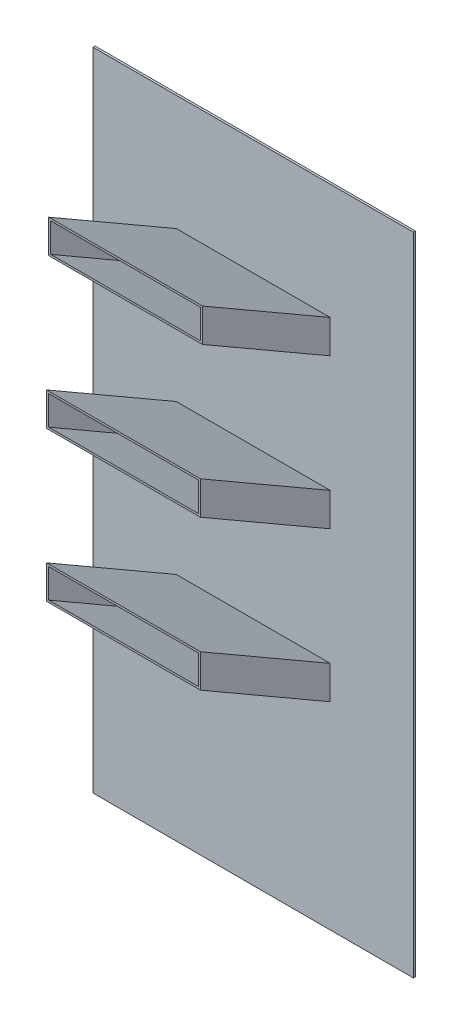
ISO-10303-21;
HEADER;
FILE_DESCRIPTION(('STEP AP214'),'2;1');
FILE_NAME('part.step','',(''),(''),'','','');
FILE_SCHEMA(('AUTOMOTIVE_DESIGN { 1 0 10303 214 1 1 1 1 }'));
ENDSEC;
DATA;
#1=APPLICATION_CONTEXT('core data for automotive mechanical design processes');
#2=APPLICATION_PROTOCOL_DEFINITION('international standard','automotive_design',2000,#1);
#3=PRODUCT_CONTEXT('',#1,'mechanical');
#4=PRODUCT('Part','Part','',(#3));
#5=PRODUCT_RELATED_PRODUCT_CATEGORY('part','',(#4));
#6=PRODUCT_DEFINITION_FORMATION('','',#4);
#7=PRODUCT_DEFINITION_CONTEXT('part definition',#1,'design');
#8=PRODUCT_DEFINITION('design','',#6,#7);
#9=PRODUCT_DEFINITION_SHAPE('','',#8);
#10=(LENGTH_UNIT() NAMED_UNIT(*) SI_UNIT(.MILLI.,.METRE.));
#11=(NAMED_UNIT(*) PLANE_ANGLE_UNIT() SI_UNIT($,.RADIAN.));
#12=(NAMED_UNIT(*) SI_UNIT($,.STERADIAN.) SOLID_ANGLE_UNIT());
#13=UNCERTAINTY_MEASURE_WITH_UNIT(LENGTH_MEASURE(1.E-05),#10,'distance_accuracy_value','');
#14=(GEOMETRIC_REPRESENTATION_CONTEXT(3) GLOBAL_UNCERTAINTY_ASSIGNED_CONTEXT((#13)) GLOBAL_UNIT_ASSIGNED_CONTEXT((#10,
#11,#12)) REPRESENTATION_CONTEXT('',''));
#15=CARTESIAN_POINT('',(0.,0.,0.));
#16=DIRECTION('',(0.,0.,1.));
#17=DIRECTION('',(1.,0.,0.));
#18=AXIS2_PLACEMENT_3D('',#15,#16,#17);
#19=CARTESIAN_POINT('',(723.899999999957,1162.04999999996,6.35));
#20=DIRECTION('',(0.,0.866025403784439,-0.5));
#21=DIRECTION('',(0.,0.5,0.866025403784439));
#22=AXIS2_PLACEMENT_3D('',#19,#20,#21);
#23=PLANE('',#22);
#24=DIRECTION('',(1.,0.,0.));
#25=VECTOR('',#24,1.);
#26=CARTESIAN_POINT('',(488.95000000001,1390.64999999996,402.296814610245));
#27=LINE('',#26,#25);
#28=CARTESIAN_POINT('',(723.899999999967,1390.64999999996,402.296814610245));
#29=VERTEX_POINT('',#28);
#30=CARTESIAN_POINT('',(254.000000000043,1390.64999999996,402.296814610245));
#31=VERTEX_POINT('',#30);
#32=EDGE_CURVE('E315',#29,#31,#27,.F.);
#33=ORIENTED_EDGE('',*,*,#32,.F.);
#34=DIRECTION('',(0.,0.5,0.866025403784439));
#35=VECTOR('',#34,1.);
#36=CARTESIAN_POINT('',(723.899999999957,1162.04999999996,6.35));
#37=LINE('',#36,#35);
#38=CARTESIAN_POINT('',(723.899999999957,1162.04999999996,6.35));
#39=VERTEX_POINT('',#38);
#40=EDGE_CURVE('E235',#39,#29,#37,.T.);
#41=ORIENTED_EDGE('',*,*,#40,.F.);
#42=DIRECTION('',(1.,0.,0.));
#43=VECTOR('',#42,1.);
#44=CARTESIAN_POINT('',(488.95,1162.04999999996,6.35));
#45=LINE('',#44,#43);
#46=CARTESIAN_POINT('',(254.000000000043,1162.04999999996,6.34999999999999));
#47=VERTEX_POINT('',#46);
#48=EDGE_CURVE('E260',#47,#39,#45,.T.);
#49=ORIENTED_EDGE('',*,*,#48,.F.);
#50=DIRECTION('',(0.,-0.5,-0.866025403784439));
#51=VECTOR('',#50,1.);
#52=CARTESIAN_POINT('',(254.000000000043,1390.64999999996,402.296814610245));
#53=LINE('',#52,#51);
#54=EDGE_CURVE('E20',#31,#47,#53,.T.);
#55=ORIENTED_EDGE('',*,*,#54,.F.);
#56=EDGE_LOOP('',(#33,#41,#49,#55));
#57=FACE_BOUND('',#56,.T.);
#58=ADVANCED_FACE('F17',(#57),#23,.T.);
#59=CARTESIAN_POINT('',(254.000000000043,1162.04999999996,6.35));
#60=DIRECTION('',(-1.,0.,0.));
#61=DIRECTION('',(0.,-1.,0.));
#62=AXIS2_PLACEMENT_3D('',#59,#60,#61);
#63=PLANE('',#62);
#64=DIRECTION('',(0.,1.,0.));
#65=VECTOR('',#64,1.);
#66=CARTESIAN_POINT('',(254.000000000043,1339.84999999997,402.296814610245));
#67=LINE('',#66,#65);
#68=CARTESIAN_POINT('',(254.000000000043,1289.04999999999,402.296814610245));
#69=VERTEX_POINT('',#68);
#70=EDGE_CURVE('E289',#31,#69,#67,.F.);
#71=ORIENTED_EDGE('',*,*,#70,.F.);
#72=ORIENTED_EDGE('',*,*,#54,.T.);
#73=DIRECTION('',(0.,1.,0.));
#74=VECTOR('',#73,1.);
#75=CARTESIAN_POINT('',(254.000000000043,985.8375,6.35));
#76=LINE('',#75,#74);
#77=CARTESIAN_POINT('',(254.000000000043,1060.44999999999,6.35));
#78=VERTEX_POINT('',#77);
#79=EDGE_CURVE('E266',#78,#47,#76,.T.);
#80=ORIENTED_EDGE('',*,*,#79,.F.);
#81=DIRECTION('',(0.,-0.5,-0.866025403784439));
#82=VECTOR('',#81,1.);
#83=CARTESIAN_POINT('',(254.000000000043,1060.44999999999,6.35));
#84=LINE('',#83,#82);
#85=EDGE_CURVE('E265',#69,#78,#84,.T.);
#86=ORIENTED_EDGE('',*,*,#85,.F.);
#87=EDGE_LOOP('',(#71,#72,#80,#86));
#88=FACE_BOUND('',#87,.T.);
#89=ADVANCED_FACE('F288',(#88),#63,.T.);
#90=CARTESIAN_POINT('',(254.000000000043,1060.44999999999,6.35));
#91=DIRECTION('',(0.,-0.866025403784439,0.5));
#92=DIRECTION('',(0.,-0.5,-0.866025403784439));
#93=AXIS2_PLACEMENT_3D('',#90,#91,#92);
#94=PLANE('',#93);
#95=DIRECTION('',(1.,0.,0.));
#96=VECTOR('',#95,1.);
#97=CARTESIAN_POINT('',(488.95000000001,1289.04999999999,402.296814610245));
#98=LINE('',#97,#96);
#99=CARTESIAN_POINT('',(723.899999999998,1289.04999999999,402.296814610245));
#100=VERTEX_POINT('',#99);
#101=EDGE_CURVE('E318',#69,#100,#98,.T.);
#102=ORIENTED_EDGE('',*,*,#101,.F.);
#103=ORIENTED_EDGE('',*,*,#85,.T.);
#104=DIRECTION('',(1.,0.,0.));
#105=VECTOR('',#104,1.);
#106=CARTESIAN_POINT('',(488.95,1060.44999999999,6.35));
#107=LINE('',#106,#105);
#108=CARTESIAN_POINT('',(723.899999999987,1060.44999999999,6.35000000000002));
#109=VERTEX_POINT('',#108);
#110=EDGE_CURVE('E258',#109,#78,#107,.F.);
#111=ORIENTED_EDGE('',*,*,#110,.F.);
#112=DIRECTION('',(0.,-0.5,-0.866025403784439));
#113=VECTOR('',#112,1.);
#114=CARTESIAN_POINT('',(723.899999999997,1289.04999999999,402.296814610245));
#115=LINE('',#114,#113);
#116=EDGE_CURVE('E242',#100,#109,#115,.T.);
#117=ORIENTED_EDGE('',*,*,#116,.F.);
#118=EDGE_LOOP('',(#102,#103,#111,#117));
#119=FACE_BOUND('',#118,.T.);
#120=ADVANCED_FACE('F263',(#119),#94,.T.);
#121=CARTESIAN_POINT('',(723.899999999997,1060.44999999999,6.35));
#122=DIRECTION('',(1.,4.01428671581138E-13,-2.31764951597804E-13));
#123=DIRECTION('',(-4.01428671581138E-13,1.,0.));
#124=AXIS2_PLACEMENT_3D('',#121,#122,#123);
#125=PLANE('',#124);
#126=DIRECTION('',(0.,1.,0.));
#127=VECTOR('',#126,1.);
#128=CARTESIAN_POINT('',(723.899999999997,1339.84999999997,402.296814610245));
#129=LINE('',#128,#127);
#130=EDGE_CURVE('E247',#100,#29,#129,.T.);
#131=ORIENTED_EDGE('',*,*,#130,.F.);
#132=ORIENTED_EDGE('',*,*,#116,.T.);
#133=DIRECTION('',(0.,1.,0.));
#134=VECTOR('',#133,1.);
#135=CARTESIAN_POINT('',(723.899999999957,985.8375,6.35));
#136=LINE('',#135,#134);
#137=EDGE_CURVE('E245',#39,#109,#136,.F.);
#138=ORIENTED_EDGE('',*,*,#137,.F.);
#139=ORIENTED_EDGE('',*,*,#40,.T.);
#140=EDGE_LOOP('',(#131,#132,#138,#139));
#141=FACE_BOUND('',#140,.T.);
#142=ADVANCED_FACE('F244',(#141),#125,.T.);
#143=CARTESIAN_POINT('',(253.999999999971,1513.98382579064,0.));
#144=DIRECTION('',(0.,-0.866025403784439,0.5));
#145=DIRECTION('',(0.,-0.5,-0.866025403784439));
#146=AXIS2_PLACEMENT_3D('',#143,#144,#145);
#147=PLANE('',#146);
#148=DIRECTION('',(1.,0.,0.));
#149=VECTOR('',#148,1.);
#150=CARTESIAN_POINT('',(488.949999999992,1742.58382579064,395.946814610245));
#151=LINE('',#150,#149);
#152=CARTESIAN_POINT('',(253.999999999977,1742.58382579064,395.946814610245));
#153=VERTEX_POINT('',#152);
#154=CARTESIAN_POINT('',(723.899999999998,1742.58382579064,395.946814610245));
#155=VERTEX_POINT('',#154);
#156=EDGE_CURVE('E325',#153,#155,#151,.T.);
#157=ORIENTED_EDGE('',*,*,#156,.F.);
#158=DIRECTION('',(0.,0.5,0.866025403784439));
#159=VECTOR('',#158,1.);
#160=CARTESIAN_POINT('',(253.999999999971,1517.65,6.35));
#161=LINE('',#160,#159);
#162=CARTESIAN_POINT('',(253.999999999971,1517.65,6.34999999999997));
#163=VERTEX_POINT('',#162);
#164=EDGE_CURVE('E280',#163,#153,#161,.T.);
#165=ORIENTED_EDGE('',*,*,#164,.F.);
#166=DIRECTION('',(1.,0.,0.));
#167=VECTOR('',#166,1.);
#168=CARTESIAN_POINT('',(488.95,1517.65,6.35));
#169=LINE('',#168,#167);
#170=CARTESIAN_POINT('',(723.899999999999,1517.65,6.34999999999997));
#171=VERTEX_POINT('',#170);
#172=EDGE_CURVE('E300',#171,#163,#169,.F.);
#173=ORIENTED_EDGE('',*,*,#172,.F.);
#174=DIRECTION('',(0.,-0.5,-0.866025403784439));
#175=VECTOR('',#174,1.);
#176=CARTESIAN_POINT('',(723.899999999997,1742.58382579064,395.946814610245));
#177=LINE('',#176,#175);
#178=EDGE_CURVE('E251',#155,#171,#177,.T.);
#179=ORIENTED_EDGE('',*,*,#178,.F.);
#180=EDGE_LOOP('',(#157,#165,#173,#179));
#181=FACE_BOUND('',#180,.T.);
#182=ADVANCED_FACE('F655',(#181),#147,.T.);
#183=CARTESIAN_POINT('',(723.899999999997,1513.98382579064,0.));
#184=DIRECTION('',(1.,0.,0.));
#185=DIRECTION('',(0.,1.,0.));
#186=AXIS2_PLACEMENT_3D('',#183,#184,#185);
#187=PLANE('',#186);
#188=DIRECTION('',(0.,1.,0.));
#189=VECTOR('',#188,1.);
#190=CARTESIAN_POINT('',(723.899999999997,1793.38382579064,395.946814610245));
#191=LINE('',#190,#189);
#192=CARTESIAN_POINT('',(723.900000000002,1844.18382579065,395.946814610245));
#193=VERTEX_POINT('',#192);
#194=EDGE_CURVE('E327',#155,#193,#191,.T.);
#195=ORIENTED_EDGE('',*,*,#194,.F.);
#196=ORIENTED_EDGE('',*,*,#178,.T.);
#197=DIRECTION('',(0.,1.,0.));
#198=VECTOR('',#197,1.);
#199=CARTESIAN_POINT('',(723.900000000003,985.8375,6.35));
#200=LINE('',#199,#198);
#201=CARTESIAN_POINT('',(723.900000000003,1619.25,6.34999999999995));
#202=VERTEX_POINT('',#201);
#203=EDGE_CURVE('E297',#202,#171,#200,.F.);
#204=ORIENTED_EDGE('',*,*,#203,.F.);
#205=DIRECTION('',(0.,0.5,0.866025403784439));
#206=VECTOR('',#205,1.);
#207=CARTESIAN_POINT('',(723.900000000003,1615.58382579065,0.));
#208=LINE('',#207,#206);
#209=EDGE_CURVE('E282',#193,#202,#208,.F.);
#210=ORIENTED_EDGE('',*,*,#209,.F.);
#211=EDGE_LOOP('',(#195,#196,#204,#210));
#212=FACE_BOUND('',#211,.T.);
#213=ADVANCED_FACE('F651',(#212),#187,.T.);
#214=CARTESIAN_POINT('',(723.900000000003,1615.58382579065,0.));
#215=DIRECTION('',(0.,0.866025403784439,-0.5));
#216=DIRECTION('',(0.,0.5,0.866025403784439));
#217=AXIS2_PLACEMENT_3D('',#214,#215,#216);
#218=PLANE('',#217);
#219=DIRECTION('',(1.,0.,0.));
#220=VECTOR('',#219,1.);
#221=CARTESIAN_POINT('',(488.949999999992,1844.18382579065,395.946814610245));
#222=LINE('',#221,#220);
#223=CARTESIAN_POINT('',(253.999999999997,1844.18382579065,395.946814610245));
#224=VERTEX_POINT('',#223);
#225=EDGE_CURVE('E329',#193,#224,#222,.F.);
#226=ORIENTED_EDGE('',*,*,#225,.F.);
#227=ORIENTED_EDGE('',*,*,#209,.T.);
#228=DIRECTION('',(1.,0.,0.));
#229=VECTOR('',#228,1.);
#230=CARTESIAN_POINT('',(488.95,1619.25,6.35));
#231=LINE('',#230,#229);
#232=CARTESIAN_POINT('',(253.99999999999,1619.25,6.34999999999997));
#233=VERTEX_POINT('',#232);
#234=EDGE_CURVE('E292',#233,#202,#231,.T.);
#235=ORIENTED_EDGE('',*,*,#234,.F.);
#236=DIRECTION('',(0.,-0.5,-0.866025403784439));
#237=VECTOR('',#236,1.);
#238=CARTESIAN_POINT('',(253.999999999997,1844.18382579065,395.946814610245));
#239=LINE('',#238,#237);
#240=EDGE_CURVE('E278',#224,#233,#239,.T.);
#241=ORIENTED_EDGE('',*,*,#240,.F.);
#242=EDGE_LOOP('',(#226,#227,#235,#241));
#243=FACE_BOUND('',#242,.T.);
#244=ADVANCED_FACE('F647',(#243),#218,.T.);
#245=CARTESIAN_POINT('',(253.999999999997,1615.58382579065,0.));
#246=DIRECTION('',(-1.,2.55263876527973E-13,-1.47376667827813E-13));
#247=DIRECTION('',(-2.55263876527973E-13,-1.,0.));
#248=AXIS2_PLACEMENT_3D('',#245,#246,#247);
#249=PLANE('',#248);
#250=DIRECTION('',(0.,1.,0.));
#251=VECTOR('',#250,1.);
#252=CARTESIAN_POINT('',(253.999999999997,1793.38382579064,395.946814610245));
#253=LINE('',#252,#251);
#254=EDGE_CURVE('E331',#224,#153,#253,.F.);
#255=ORIENTED_EDGE('',*,*,#254,.F.);
#256=ORIENTED_EDGE('',*,*,#240,.T.);
#257=DIRECTION('',(0.,1.,0.));
#258=VECTOR('',#257,1.);
#259=CARTESIAN_POINT('',(253.999999999971,985.8375,6.35));
#260=LINE('',#259,#258);
#261=EDGE_CURVE('E290',#163,#233,#260,.T.);
#262=ORIENTED_EDGE('',*,*,#261,.F.);
#263=ORIENTED_EDGE('',*,*,#164,.T.);
#264=EDGE_LOOP('',(#255,#256,#262,#263));
#265=FACE_BOUND('',#264,.T.);
#266=ADVANCED_FACE('F643',(#265),#249,.T.);
#267=CARTESIAN_POINT('',(723.899999999957,704.849999999957,6.35));
#268=DIRECTION('',(0.,0.866025403784439,-0.5));
#269=DIRECTION('',(0.,0.5,0.866025403784439));
#270=AXIS2_PLACEMENT_3D('',#267,#268,#269);
#271=PLANE('',#270);
#272=DIRECTION('',(1.,0.,0.));
#273=VECTOR('',#272,1.);
#274=CARTESIAN_POINT('',(488.95000000001,933.449999999957,402.296814610245));
#275=LINE('',#274,#273);
#276=CARTESIAN_POINT('',(723.899999999967,933.449999999957,402.296814610245));
#277=VERTEX_POINT('',#276);
#278=CARTESIAN_POINT('',(254.000000000043,933.449999999957,402.296814610245));
#279=VERTEX_POINT('',#278);
#280=EDGE_CURVE('E338',#277,#279,#275,.F.);
#281=ORIENTED_EDGE('',*,*,#280,.F.);
#282=DIRECTION('',(0.,0.5,0.866025403784439));
#283=VECTOR('',#282,1.);
#284=CARTESIAN_POINT('',(723.899999999957,704.849999999957,6.35));
#285=LINE('',#284,#283);
#286=CARTESIAN_POINT('',(723.899999999957,704.849999999957,6.35));
#287=VERTEX_POINT('',#286);
#288=EDGE_CURVE('E272',#287,#277,#285,.T.);
#289=ORIENTED_EDGE('',*,*,#288,.F.);
#290=DIRECTION('',(1.,0.,0.));
#291=VECTOR('',#290,1.);
#292=CARTESIAN_POINT('',(488.95,704.849999999957,6.35));
#293=LINE('',#292,#291);
#294=CARTESIAN_POINT('',(254.000000000043,704.849999999957,6.35));
#295=VERTEX_POINT('',#294);
#296=EDGE_CURVE('E312',#295,#287,#293,.T.);
#297=ORIENTED_EDGE('',*,*,#296,.F.);
#298=DIRECTION('',(0.,-0.5,-0.866025403784439));
#299=VECTOR('',#298,1.);
#300=CARTESIAN_POINT('',(254.000000000043,933.449999999957,402.296814610245));
#301=LINE('',#300,#299);
#302=EDGE_CURVE('E276',#279,#295,#301,.T.);
#303=ORIENTED_EDGE('',*,*,#302,.F.);
#304=EDGE_LOOP('',(#281,#289,#297,#303));
#305=FACE_BOUND('',#304,.T.);
#306=ADVANCED_FACE('F639',(#305),#271,.T.);
#307=CARTESIAN_POINT('',(254.000000000043,704.849999999957,6.35));
#308=DIRECTION('',(-1.,0.,0.));
#309=DIRECTION('',(0.,-1.,0.));
#310=AXIS2_PLACEMENT_3D('',#307,#308,#309);
#311=PLANE('',#310);
#312=DIRECTION('',(0.,1.,0.));
#313=VECTOR('',#312,1.);
#314=CARTESIAN_POINT('',(254.000000000043,882.64999999997,402.296814610245));
#315=LINE('',#314,#313);
#316=CARTESIAN_POINT('',(254.000000000043,831.849999999985,402.296814610245));
#317=VERTEX_POINT('',#316);
#318=EDGE_CURVE('E340',#279,#317,#315,.F.);
#319=ORIENTED_EDGE('',*,*,#318,.F.);
#320=ORIENTED_EDGE('',*,*,#302,.T.);
#321=DIRECTION('',(0.,1.,0.));
#322=VECTOR('',#321,1.);
#323=CARTESIAN_POINT('',(254.000000000043,985.8375,6.35));
#324=LINE('',#323,#322);
#325=CARTESIAN_POINT('',(254.000000000043,603.249999999985,6.35));
#326=VERTEX_POINT('',#325);
#327=EDGE_CURVE('E309',#326,#295,#324,.T.);
#328=ORIENTED_EDGE('',*,*,#327,.F.);
#329=DIRECTION('',(0.,-0.5,-0.866025403784439));
#330=VECTOR('',#329,1.);
#331=CARTESIAN_POINT('',(254.000000000043,603.249999999985,6.35));
#332=LINE('',#331,#330);
#333=EDGE_CURVE('E274',#317,#326,#332,.T.);
#334=ORIENTED_EDGE('',*,*,#333,.F.);
#335=EDGE_LOOP('',(#319,#320,#328,#334));
#336=FACE_BOUND('',#335,.T.);
#337=ADVANCED_FACE('F635',(#336),#311,.T.);
#338=CARTESIAN_POINT('',(254.000000000043,603.249999999985,6.35));
#339=DIRECTION('',(0.,-0.866025403784439,0.5));
#340=DIRECTION('',(0.,-0.5,-0.866025403784439));
#341=AXIS2_PLACEMENT_3D('',#338,#339,#340);
#342=PLANE('',#341);
#343=DIRECTION('',(1.,0.,0.));
#344=VECTOR('',#343,1.);
#345=CARTESIAN_POINT('',(488.95000000001,831.849999999985,402.296814610245));
#346=LINE('',#345,#344);
#347=CARTESIAN_POINT('',(723.899999999998,831.849999999985,402.296814610245));
#348=VERTEX_POINT('',#347);
#349=EDGE_CURVE('E342',#317,#348,#346,.T.);
#350=ORIENTED_EDGE('',*,*,#349,.F.);
#351=ORIENTED_EDGE('',*,*,#333,.T.);
#352=DIRECTION('',(1.,0.,0.));
#353=VECTOR('',#352,1.);
#354=CARTESIAN_POINT('',(488.95,603.249999999985,6.35));
#355=LINE('',#354,#353);
#356=CARTESIAN_POINT('',(723.899999999987,603.249999999985,6.35));
#357=VERTEX_POINT('',#356);
#358=EDGE_CURVE('E306',#357,#326,#355,.F.);
#359=ORIENTED_EDGE('',*,*,#358,.F.);
#360=DIRECTION('',(0.,-0.5,-0.866025403784439));
#361=VECTOR('',#360,1.);
#362=CARTESIAN_POINT('',(723.899999999997,831.849999999985,402.296814610245));
#363=LINE('',#362,#361);
#364=EDGE_CURVE('E261',#348,#357,#363,.T.);
#365=ORIENTED_EDGE('',*,*,#364,.F.);
#366=EDGE_LOOP('',(#350,#351,#359,#365));
#367=FACE_BOUND('',#366,.T.);
#368=ADVANCED_FACE('F631',(#367),#342,.T.);
#369=CARTESIAN_POINT('',(723.899999999997,603.249999999985,6.35));
#370=DIRECTION('',(1.,4.00029965408359E-13,-2.30957408212433E-13));
#371=DIRECTION('',(-4.00029965408359E-13,1.,0.));
#372=AXIS2_PLACEMENT_3D('',#369,#370,#371);
#373=PLANE('',#372);
#374=DIRECTION('',(0.,1.,0.));
#375=VECTOR('',#374,1.);
#376=CARTESIAN_POINT('',(723.899999999997,882.64999999997,402.296814610245));
#377=LINE('',#376,#375);
#378=EDGE_CURVE('E344',#348,#277,#377,.T.);
#379=ORIENTED_EDGE('',*,*,#378,.F.);
#380=ORIENTED_EDGE('',*,*,#364,.T.);
#381=DIRECTION('',(0.,1.,0.));
#382=VECTOR('',#381,1.);
#383=CARTESIAN_POINT('',(723.899999999957,985.8375,6.35));
#384=LINE('',#383,#382);
#385=EDGE_CURVE('E303',#287,#357,#384,.F.);
#386=ORIENTED_EDGE('',*,*,#385,.F.);
#387=ORIENTED_EDGE('',*,*,#288,.T.);
#388=EDGE_LOOP('',(#379,#380,#386,#387));
#389=FACE_BOUND('',#388,.T.);
#390=ADVANCED_FACE('F627',(#389),#373,.T.);
#391=CARTESIAN_POINT('',(488.95,985.8375,6.35));
#392=DIRECTION('',(0.,0.,1.));
#393=DIRECTION('',(1.,0.,0.));
#394=AXIS2_PLACEMENT_3D('',#391,#392,#393);
#395=PLANE('',#394);
#396=ORIENTED_EDGE('',*,*,#327,.T.);
#397=ORIENTED_EDGE('',*,*,#296,.T.);
#398=ORIENTED_EDGE('',*,*,#385,.T.);
#399=ORIENTED_EDGE('',*,*,#358,.T.);
#400=EDGE_LOOP('',(#396,#397,#398,#399));
#401=FACE_BOUND('',#400,.T.);
#402=ORIENTED_EDGE('',*,*,#203,.T.);
#403=ORIENTED_EDGE('',*,*,#172,.T.);
#404=ORIENTED_EDGE('',*,*,#261,.T.);
#405=ORIENTED_EDGE('',*,*,#234,.T.);
#406=EDGE_LOOP('',(#402,#403,#404,#405));
#407=FACE_BOUND('',#406,.T.);
#408=ORIENTED_EDGE('',*,*,#79,.T.);
#409=ORIENTED_EDGE('',*,*,#48,.T.);
#410=ORIENTED_EDGE('',*,*,#137,.T.);
#411=ORIENTED_EDGE('',*,*,#110,.T.);
#412=EDGE_LOOP('',(#408,#409,#410,#411));
#413=FACE_BOUND('',#412,.T.);
#414=DIRECTION('',(1.,0.,0.));
#415=VECTOR('',#414,1.);
#416=CARTESIAN_POINT('',(977.9,1971.675,6.35));
#417=LINE('',#416,#415);
#418=CARTESIAN_POINT('',(0.,1971.675,6.35));
#419=VERTEX_POINT('',#418);
#420=CARTESIAN_POINT('',(977.9,1971.675,6.35));
#421=VERTEX_POINT('',#420);
#422=EDGE_CURVE('E353',#419,#421,#417,.T.);
#423=ORIENTED_EDGE('',*,*,#422,.F.);
#424=DIRECTION('',(0.,1.,0.));
#425=VECTOR('',#424,1.);
#426=CARTESIAN_POINT('',(0.,1971.675,6.35));
#427=LINE('',#426,#425);
#428=CARTESIAN_POINT('',(0.,0.,6.35));
#429=VERTEX_POINT('',#428);
#430=EDGE_CURVE('E357',#429,#419,#427,.T.);
#431=ORIENTED_EDGE('',*,*,#430,.F.);
#432=DIRECTION('',(1.,0.,0.));
#433=VECTOR('',#432,1.);
#434=CARTESIAN_POINT('',(0.,0.,6.35));
#435=LINE('',#434,#433);
#436=CARTESIAN_POINT('',(977.9,0.,6.35));
#437=VERTEX_POINT('',#436);
#438=EDGE_CURVE('E364',#437,#429,#435,.F.);
#439=ORIENTED_EDGE('',*,*,#438,.F.);
#440=DIRECTION('',(0.,1.,0.));
#441=VECTOR('',#440,1.);
#442=CARTESIAN_POINT('',(977.9,0.,6.35));
#443=LINE('',#442,#441);
#444=EDGE_CURVE('E351',#421,#437,#443,.F.);
#445=ORIENTED_EDGE('',*,*,#444,.F.);
#446=EDGE_LOOP('',(#423,#431,#439,#445));
#447=FACE_BOUND('',#446,.T.);
#448=ADVANCED_FACE('F256',(#401,#407,#413,#447),#395,.T.);
#449=CARTESIAN_POINT('',(717.55,1155.7,6.35));
#450=DIRECTION('',(0.,0.866025403784439,-0.5));
#451=DIRECTION('',(0.,0.5,0.866025403784439));
#452=AXIS2_PLACEMENT_3D('',#449,#450,#451);
#453=PLANE('',#452);
#454=DIRECTION('',(0.,0.5,0.866025403784439));
#455=VECTOR('',#454,1.);
#456=CARTESIAN_POINT('',(717.55,1155.7,6.35));
#457=LINE('',#456,#455);
#458=CARTESIAN_POINT('',(717.55,1155.7,6.35));
#459=VERTEX_POINT('',#458);
#460=CARTESIAN_POINT('',(717.55,1384.3,402.296814610245));
#461=VERTEX_POINT('',#460);
#462=EDGE_CURVE('E384',#459,#461,#457,.T.);
#463=ORIENTED_EDGE('',*,*,#462,.T.);
#464=DIRECTION('',(1.,0.,0.));
#465=VECTOR('',#464,1.);
#466=CARTESIAN_POINT('',(488.95000000001,1384.3,402.296814610245));
#467=LINE('',#466,#465);
#468=CARTESIAN_POINT('',(260.35,1384.3,402.296814610245));
#469=VERTEX_POINT('',#468);
#470=EDGE_CURVE('E321',#469,#461,#467,.T.);
#471=ORIENTED_EDGE('',*,*,#470,.F.);
#472=DIRECTION('',(0.,-0.5,-0.866025403784439));
#473=VECTOR('',#472,1.);
#474=CARTESIAN_POINT('',(260.35,1384.3,402.296814610245));
#475=LINE('',#474,#473);
#476=CARTESIAN_POINT('',(260.35,1155.7,6.35000000000012));
#477=VERTEX_POINT('',#476);
#478=EDGE_CURVE('E374',#469,#477,#475,.T.);
#479=ORIENTED_EDGE('',*,*,#478,.T.);
#480=DIRECTION('',(1.,0.,0.));
#481=VECTOR('',#480,1.);
#482=CARTESIAN_POINT('',(717.55,1155.7,6.35));
#483=LINE('',#482,#481);
#484=EDGE_CURVE('E379',#477,#459,#483,.T.);
#485=ORIENTED_EDGE('',*,*,#484,.T.);
#486=EDGE_LOOP('',(#463,#471,#479,#485));
#487=FACE_BOUND('',#486,.T.);
#488=ADVANCED_FACE('F620',(#487),#453,.F.);
#489=CARTESIAN_POINT('',(488.95000000001,1339.84999999997,402.296814610245));
#490=DIRECTION('',(0.,0.,1.));
#491=DIRECTION('',(1.,0.,0.));
#492=AXIS2_PLACEMENT_3D('',#489,#490,#491);
#493=PLANE('',#492);
#494=DIRECTION('',(0.,-1.,0.));
#495=VECTOR('',#494,1.);
#496=CARTESIAN_POINT('',(260.35,1155.7,402.296814610245));
#497=LINE('',#496,#495);
#498=CARTESIAN_POINT('',(260.35,1295.4,402.296814610245));
#499=VERTEX_POINT('',#498);
#500=EDGE_CURVE('E371',#499,#469,#497,.F.);
#501=ORIENTED_EDGE('',*,*,#500,.T.);
#502=ORIENTED_EDGE('',*,*,#470,.T.);
#503=DIRECTION('',(0.,1.,0.));
#504=VECTOR('',#503,1.);
#505=CARTESIAN_POINT('',(717.55,1066.8,402.296814610245));
#506=LINE('',#505,#504);
#507=CARTESIAN_POINT('',(717.55,1295.4,402.296814610245));
#508=VERTEX_POINT('',#507);
#509=EDGE_CURVE('E387',#461,#508,#506,.F.);
#510=ORIENTED_EDGE('',*,*,#509,.T.);
#511=DIRECTION('',(1.,0.,0.));
#512=VECTOR('',#511,1.);
#513=CARTESIAN_POINT('',(260.35,1295.4,402.296814610245));
#514=LINE('',#513,#512);
#515=EDGE_CURVE('E323',#508,#499,#514,.F.);
#516=ORIENTED_EDGE('',*,*,#515,.T.);
#517=EDGE_LOOP('',(#501,#502,#510,#516));
#518=FACE_BOUND('',#517,.T.);
#519=ORIENTED_EDGE('',*,*,#101,.T.);
#520=ORIENTED_EDGE('',*,*,#130,.T.);
#521=ORIENTED_EDGE('',*,*,#32,.T.);
#522=ORIENTED_EDGE('',*,*,#70,.T.);
#523=EDGE_LOOP('',(#519,#520,#521,#522));
#524=FACE_BOUND('',#523,.T.);
#525=ADVANCED_FACE('F616',(#518,#524),#493,.T.);
#526=CARTESIAN_POINT('',(260.35,1066.8,6.35));
#527=DIRECTION('',(0.,-0.866025403784439,0.5));
#528=DIRECTION('',(0.,-0.5,-0.866025403784439));
#529=AXIS2_PLACEMENT_3D('',#526,#527,#528);
#530=PLANE('',#529);
#531=DIRECTION('',(0.,0.5,0.866025403784439));
#532=VECTOR('',#531,1.);
#533=CARTESIAN_POINT('',(260.35,1066.8,6.35));
#534=LINE('',#533,#532);
#535=CARTESIAN_POINT('',(260.35,1066.8,6.35));
#536=VERTEX_POINT('',#535);
#537=EDGE_CURVE('E368',#536,#499,#534,.T.);
#538=ORIENTED_EDGE('',*,*,#537,.T.);
#539=ORIENTED_EDGE('',*,*,#515,.F.);
#540=DIRECTION('',(0.,-0.5,-0.866025403784439));
#541=VECTOR('',#540,1.);
#542=CARTESIAN_POINT('',(717.55,1295.4,402.296814610245));
#543=LINE('',#542,#541);
#544=CARTESIAN_POINT('',(717.55,1066.8,6.35000000000012));
#545=VERTEX_POINT('',#544);
#546=EDGE_CURVE('E390',#508,#545,#543,.T.);
#547=ORIENTED_EDGE('',*,*,#546,.T.);
#548=DIRECTION('',(1.,0.,0.));
#549=VECTOR('',#548,1.);
#550=CARTESIAN_POINT('',(260.35,1066.8,6.35));
#551=LINE('',#550,#549);
#552=EDGE_CURVE('E395',#545,#536,#551,.F.);
#553=ORIENTED_EDGE('',*,*,#552,.T.);
#554=EDGE_LOOP('',(#538,#539,#547,#553));
#555=FACE_BOUND('',#554,.T.);
#556=ADVANCED_FACE('F612',(#555),#530,.F.);
#557=CARTESIAN_POINT('',(717.55,1609.23382579065,0.));
#558=DIRECTION('',(0.,0.866025403784439,-0.5));
#559=DIRECTION('',(0.,0.5,0.866025403784439));
#560=AXIS2_PLACEMENT_3D('',#557,#558,#559);
#561=PLANE('',#560);
#562=DIRECTION('',(0.,0.5,0.866025403784439));
#563=VECTOR('',#562,1.);
#564=CARTESIAN_POINT('',(717.55,1612.9,6.35));
#565=LINE('',#564,#563);
#566=CARTESIAN_POINT('',(717.55,1612.9,6.34999999999997));
#567=VERTEX_POINT('',#566);
#568=CARTESIAN_POINT('',(717.55,1837.83382579065,395.946814610245));
#569=VERTEX_POINT('',#568);
#570=EDGE_CURVE('E417',#567,#569,#565,.T.);
#571=ORIENTED_EDGE('',*,*,#570,.T.);
#572=DIRECTION('',(1.,0.,0.));
#573=VECTOR('',#572,1.);
#574=CARTESIAN_POINT('',(488.949999999992,1837.83382579065,395.946814610245));
#575=LINE('',#574,#573);
#576=CARTESIAN_POINT('',(260.35,1837.83382579065,395.946814610245));
#577=VERTEX_POINT('',#576);
#578=EDGE_CURVE('E334',#577,#569,#575,.T.);
#579=ORIENTED_EDGE('',*,*,#578,.F.);
#580=DIRECTION('',(0.,-0.5,-0.866025403784439));
#581=VECTOR('',#580,1.);
#582=CARTESIAN_POINT('',(260.35,1837.83382579065,395.946814610245));
#583=LINE('',#582,#581);
#584=CARTESIAN_POINT('',(260.35,1612.9,6.3499999999999));
#585=VERTEX_POINT('',#584);
#586=EDGE_CURVE('E407',#577,#585,#583,.T.);
#587=ORIENTED_EDGE('',*,*,#586,.T.);
#588=DIRECTION('',(1.,0.,0.));
#589=VECTOR('',#588,1.);
#590=CARTESIAN_POINT('',(717.55,1612.9,6.35));
#591=LINE('',#590,#589);
#592=EDGE_CURVE('E412',#585,#567,#591,.T.);
#593=ORIENTED_EDGE('',*,*,#592,.T.);
#594=EDGE_LOOP('',(#571,#579,#587,#593));
#595=FACE_BOUND('',#594,.T.);
#596=ADVANCED_FACE('F608',(#595),#561,.F.);
#597=CARTESIAN_POINT('',(488.949999999992,1793.38382579064,395.946814610245));
#598=DIRECTION('',(0.,0.,1.));
#599=DIRECTION('',(1.,0.,0.));
#600=AXIS2_PLACEMENT_3D('',#597,#598,#599);
#601=PLANE('',#600);
#602=DIRECTION('',(0.,-1.,0.));
#603=VECTOR('',#602,1.);
#604=CARTESIAN_POINT('',(260.35,1609.23382579065,395.946814610245));
#605=LINE('',#604,#603);
#606=CARTESIAN_POINT('',(260.35,1748.93382579065,395.946814610245));
#607=VERTEX_POINT('',#606);
#608=EDGE_CURVE('E404',#607,#577,#605,.F.);
#609=ORIENTED_EDGE('',*,*,#608,.T.);
#610=ORIENTED_EDGE('',*,*,#578,.T.);
#611=DIRECTION('',(0.,1.,0.));
#612=VECTOR('',#611,1.);
#613=CARTESIAN_POINT('',(717.55,1520.33382579065,395.946814610245));
#614=LINE('',#613,#612);
#615=CARTESIAN_POINT('',(717.55,1748.93382579065,395.946814610245));
#616=VERTEX_POINT('',#615);
#617=EDGE_CURVE('E420',#569,#616,#614,.F.);
#618=ORIENTED_EDGE('',*,*,#617,.T.);
#619=DIRECTION('',(1.,0.,0.));
#620=VECTOR('',#619,1.);
#621=CARTESIAN_POINT('',(260.35,1748.93382579065,395.946814610245));
#622=LINE('',#621,#620);
#623=EDGE_CURVE('E336',#616,#607,#622,.F.);
#624=ORIENTED_EDGE('',*,*,#623,.T.);
#625=EDGE_LOOP('',(#609,#610,#618,#624));
#626=FACE_BOUND('',#625,.T.);
#627=ORIENTED_EDGE('',*,*,#225,.T.);
#628=ORIENTED_EDGE('',*,*,#254,.T.);
#629=ORIENTED_EDGE('',*,*,#156,.T.);
#630=ORIENTED_EDGE('',*,*,#194,.T.);
#631=EDGE_LOOP('',(#627,#628,#629,#630));
#632=FACE_BOUND('',#631,.T.);
#633=ADVANCED_FACE('F604',(#626,#632),#601,.T.);
#634=CARTESIAN_POINT('',(260.35,1520.33382579065,0.));
#635=DIRECTION('',(0.,-0.866025403784439,0.5));
#636=DIRECTION('',(0.,-0.5,-0.866025403784439));
#637=AXIS2_PLACEMENT_3D('',#634,#635,#636);
#638=PLANE('',#637);
#639=DIRECTION('',(0.,0.5,0.866025403784439));
#640=VECTOR('',#639,1.);
#641=CARTESIAN_POINT('',(260.35,1524.,6.35));
#642=LINE('',#641,#640);
#643=CARTESIAN_POINT('',(260.35,1524.,6.34999999999995));
#644=VERTEX_POINT('',#643);
#645=EDGE_CURVE('E401',#644,#607,#642,.T.);
#646=ORIENTED_EDGE('',*,*,#645,.T.);
#647=ORIENTED_EDGE('',*,*,#623,.F.);
#648=DIRECTION('',(0.,-0.5,-0.866025403784439));
#649=VECTOR('',#648,1.);
#650=CARTESIAN_POINT('',(717.55,1748.93382579065,395.946814610245));
#651=LINE('',#650,#649);
#652=CARTESIAN_POINT('',(717.55,1524.,6.3499999999999));
#653=VERTEX_POINT('',#652);
#654=EDGE_CURVE('E423',#616,#653,#651,.T.);
#655=ORIENTED_EDGE('',*,*,#654,.T.);
#656=DIRECTION('',(1.,0.,0.));
#657=VECTOR('',#656,1.);
#658=CARTESIAN_POINT('',(260.35,1524.,6.35));
#659=LINE('',#658,#657);
#660=EDGE_CURVE('E428',#653,#644,#659,.F.);
#661=ORIENTED_EDGE('',*,*,#660,.T.);
#662=EDGE_LOOP('',(#646,#647,#655,#661));
#663=FACE_BOUND('',#662,.T.);
#664=ADVANCED_FACE('F600',(#663),#638,.F.);
#665=CARTESIAN_POINT('',(717.55,698.5,6.35));
#666=DIRECTION('',(0.,0.866025403784439,-0.5));
#667=DIRECTION('',(0.,0.5,0.866025403784439));
#668=AXIS2_PLACEMENT_3D('',#665,#666,#667);
#669=PLANE('',#668);
#670=DIRECTION('',(0.,0.5,0.866025403784439));
#671=VECTOR('',#670,1.);
#672=CARTESIAN_POINT('',(717.55,698.5,6.35));
#673=LINE('',#672,#671);
#674=CARTESIAN_POINT('',(717.55,698.5,6.35));
#675=VERTEX_POINT('',#674);
#676=CARTESIAN_POINT('',(717.55,927.1,402.296814610245));
#677=VERTEX_POINT('',#676);
#678=EDGE_CURVE('E450',#675,#677,#673,.T.);
#679=ORIENTED_EDGE('',*,*,#678,.T.);
#680=DIRECTION('',(1.,0.,0.));
#681=VECTOR('',#680,1.);
#682=CARTESIAN_POINT('',(488.95000000001,927.1,402.296814610245));
#683=LINE('',#682,#681);
#684=CARTESIAN_POINT('',(260.35,927.1,402.296814610245));
#685=VERTEX_POINT('',#684);
#686=EDGE_CURVE('E347',#685,#677,#683,.T.);
#687=ORIENTED_EDGE('',*,*,#686,.F.);
#688=DIRECTION('',(0.,-0.5,-0.866025403784439));
#689=VECTOR('',#688,1.);
#690=CARTESIAN_POINT('',(260.35,927.1,402.296814610245));
#691=LINE('',#690,#689);
#692=CARTESIAN_POINT('',(260.35,698.5,6.35000000000012));
#693=VERTEX_POINT('',#692);
#694=EDGE_CURVE('E440',#685,#693,#691,.T.);
#695=ORIENTED_EDGE('',*,*,#694,.T.);
#696=DIRECTION('',(1.,0.,0.));
#697=VECTOR('',#696,1.);
#698=CARTESIAN_POINT('',(717.55,698.5,6.35));
#699=LINE('',#698,#697);
#700=EDGE_CURVE('E445',#693,#675,#699,.T.);
#701=ORIENTED_EDGE('',*,*,#700,.T.);
#702=EDGE_LOOP('',(#679,#687,#695,#701));
#703=FACE_BOUND('',#702,.T.);
#704=ADVANCED_FACE('F596',(#703),#669,.F.);
#705=CARTESIAN_POINT('',(488.95000000001,882.64999999997,402.296814610245));
#706=DIRECTION('',(0.,0.,1.));
#707=DIRECTION('',(1.,0.,0.));
#708=AXIS2_PLACEMENT_3D('',#705,#706,#707);
#709=PLANE('',#708);
#710=DIRECTION('',(0.,-1.,0.));
#711=VECTOR('',#710,1.);
#712=CARTESIAN_POINT('',(260.35,698.5,402.296814610245));
#713=LINE('',#712,#711);
#714=CARTESIAN_POINT('',(260.35,838.2,402.296814610245));
#715=VERTEX_POINT('',#714);
#716=EDGE_CURVE('E437',#715,#685,#713,.F.);
#717=ORIENTED_EDGE('',*,*,#716,.T.);
#718=ORIENTED_EDGE('',*,*,#686,.T.);
#719=DIRECTION('',(0.,1.,0.));
#720=VECTOR('',#719,1.);
#721=CARTESIAN_POINT('',(717.55,609.6,402.296814610245));
#722=LINE('',#721,#720);
#723=CARTESIAN_POINT('',(717.55,838.2,402.296814610245));
#724=VERTEX_POINT('',#723);
#725=EDGE_CURVE('E453',#677,#724,#722,.F.);
#726=ORIENTED_EDGE('',*,*,#725,.T.);
#727=DIRECTION('',(1.,0.,0.));
#728=VECTOR('',#727,1.);
#729=CARTESIAN_POINT('',(260.35,838.2,402.296814610245));
#730=LINE('',#729,#728);
#731=EDGE_CURVE('E349',#724,#715,#730,.F.);
#732=ORIENTED_EDGE('',*,*,#731,.T.);
#733=EDGE_LOOP('',(#717,#718,#726,#732));
#734=FACE_BOUND('',#733,.T.);
#735=ORIENTED_EDGE('',*,*,#349,.T.);
#736=ORIENTED_EDGE('',*,*,#378,.T.);
#737=ORIENTED_EDGE('',*,*,#280,.T.);
#738=ORIENTED_EDGE('',*,*,#318,.T.);
#739=EDGE_LOOP('',(#735,#736,#737,#738));
#740=FACE_BOUND('',#739,.T.);
#741=ADVANCED_FACE('F592',(#734,#740),#709,.T.);
#742=CARTESIAN_POINT('',(260.35,609.6,6.35));
#743=DIRECTION('',(0.,-0.866025403784439,0.5));
#744=DIRECTION('',(0.,-0.5,-0.866025403784439));
#745=AXIS2_PLACEMENT_3D('',#742,#743,#744);
#746=PLANE('',#745);
#747=DIRECTION('',(0.,0.5,0.866025403784439));
#748=VECTOR('',#747,1.);
#749=CARTESIAN_POINT('',(260.35,609.6,6.35));
#750=LINE('',#749,#748);
#751=CARTESIAN_POINT('',(260.35,609.6,6.35));
#752=VERTEX_POINT('',#751);
#753=EDGE_CURVE('E434',#752,#715,#750,.T.);
#754=ORIENTED_EDGE('',*,*,#753,.T.);
#755=ORIENTED_EDGE('',*,*,#731,.F.);
#756=DIRECTION('',(0.,-0.5,-0.866025403784439));
#757=VECTOR('',#756,1.);
#758=CARTESIAN_POINT('',(717.55,838.2,402.296814610245));
#759=LINE('',#758,#757);
#760=CARTESIAN_POINT('',(717.55,609.6,6.35));
#761=VERTEX_POINT('',#760);
#762=EDGE_CURVE('E456',#724,#761,#759,.T.);
#763=ORIENTED_EDGE('',*,*,#762,.T.);
#764=DIRECTION('',(1.,0.,0.));
#765=VECTOR('',#764,1.);
#766=CARTESIAN_POINT('',(260.35,609.6,6.35));
#767=LINE('',#766,#765);
#768=EDGE_CURVE('E459',#761,#752,#767,.F.);
#769=ORIENTED_EDGE('',*,*,#768,.T.);
#770=EDGE_LOOP('',(#754,#755,#763,#769));
#771=FACE_BOUND('',#770,.T.);
#772=ADVANCED_FACE('F588',(#771),#746,.F.);
#773=CARTESIAN_POINT('',(977.9,0.,0.));
#774=DIRECTION('',(1.,0.,0.));
#775=DIRECTION('',(0.,0.,-1.));
#776=AXIS2_PLACEMENT_3D('',#773,#774,#775);
#777=PLANE('',#776);
#778=ORIENTED_EDGE('',*,*,#444,.T.);
#779=DIRECTION('',(0.,0.,-1.));
#780=VECTOR('',#779,1.);
#781=CARTESIAN_POINT('',(977.9,0.,0.));
#782=LINE('',#781,#780);
#783=CARTESIAN_POINT('',(977.9,0.,0.));
#784=VERTEX_POINT('',#783);
#785=EDGE_CURVE('E361',#784,#437,#782,.F.);
#786=ORIENTED_EDGE('',*,*,#785,.F.);
#787=DIRECTION('',(0.,1.,0.));
#788=VECTOR('',#787,1.);
#789=CARTESIAN_POINT('',(977.9,985.8375,0.));
#790=LINE('',#789,#788);
#791=CARTESIAN_POINT('',(977.9,1971.675,0.));
#792=VERTEX_POINT('',#791);
#793=EDGE_CURVE('E465',#784,#792,#790,.T.);
#794=ORIENTED_EDGE('',*,*,#793,.T.);
#795=DIRECTION('',(0.,0.,1.));
#796=VECTOR('',#795,1.);
#797=CARTESIAN_POINT('',(977.9,1971.675,0.));
#798=LINE('',#797,#796);
#799=EDGE_CURVE('E355',#421,#792,#798,.F.);
#800=ORIENTED_EDGE('',*,*,#799,.F.);
#801=EDGE_LOOP('',(#778,#786,#794,#800));
#802=FACE_BOUND('',#801,.T.);
#803=ADVANCED_FACE('F584',(#802),#777,.T.);
#804=CARTESIAN_POINT('',(977.9,1971.675,0.));
#805=DIRECTION('',(0.,1.,0.));
#806=DIRECTION('',(0.,0.,1.));
#807=AXIS2_PLACEMENT_3D('',#804,#805,#806);
#808=PLANE('',#807);
#809=ORIENTED_EDGE('',*,*,#422,.T.);
#810=ORIENTED_EDGE('',*,*,#799,.T.);
#811=DIRECTION('',(1.,0.,0.));
#812=VECTOR('',#811,1.);
#813=CARTESIAN_POINT('',(488.95,1971.675,0.));
#814=LINE('',#813,#812);
#815=CARTESIAN_POINT('',(0.,1971.675,0.));
#816=VERTEX_POINT('',#815);
#817=EDGE_CURVE('E468',#792,#816,#814,.F.);
#818=ORIENTED_EDGE('',*,*,#817,.T.);
#819=DIRECTION('',(0.,0.,1.));
#820=VECTOR('',#819,1.);
#821=CARTESIAN_POINT('',(0.,1971.675,0.));
#822=LINE('',#821,#820);
#823=EDGE_CURVE('E359',#419,#816,#822,.F.);
#824=ORIENTED_EDGE('',*,*,#823,.F.);
#825=EDGE_LOOP('',(#809,#810,#818,#824));
#826=FACE_BOUND('',#825,.T.);
#827=ADVANCED_FACE('F580',(#826),#808,.T.);
#828=CARTESIAN_POINT('',(0.,1971.675,0.));
#829=DIRECTION('',(-1.,0.,0.));
#830=DIRECTION('',(0.,0.,1.));
#831=AXIS2_PLACEMENT_3D('',#828,#829,#830);
#832=PLANE('',#831);
#833=ORIENTED_EDGE('',*,*,#430,.T.);
#834=ORIENTED_EDGE('',*,*,#823,.T.);
#835=DIRECTION('',(0.,1.,0.));
#836=VECTOR('',#835,1.);
#837=CARTESIAN_POINT('',(0.,985.8375,0.));
#838=LINE('',#837,#836);
#839=CARTESIAN_POINT('',(0.,0.,0.));
#840=VERTEX_POINT('',#839);
#841=EDGE_CURVE('E471',#816,#840,#838,.F.);
#842=ORIENTED_EDGE('',*,*,#841,.T.);
#843=DIRECTION('',(0.,0.,-1.));
#844=VECTOR('',#843,1.);
#845=CARTESIAN_POINT('',(0.,0.,0.));
#846=LINE('',#845,#844);
#847=EDGE_CURVE('E366',#429,#840,#846,.T.);
#848=ORIENTED_EDGE('',*,*,#847,.F.);
#849=EDGE_LOOP('',(#833,#834,#842,#848));
#850=FACE_BOUND('',#849,.T.);
#851=ADVANCED_FACE('F576',(#850),#832,.T.);
#852=CARTESIAN_POINT('',(0.,0.,0.));
#853=DIRECTION('',(0.,-1.,0.));
#854=DIRECTION('',(0.,0.,-1.));
#855=AXIS2_PLACEMENT_3D('',#852,#853,#854);
#856=PLANE('',#855);
#857=ORIENTED_EDGE('',*,*,#438,.T.);
#858=ORIENTED_EDGE('',*,*,#847,.T.);
#859=DIRECTION('',(1.,0.,0.));
#860=VECTOR('',#859,1.);
#861=CARTESIAN_POINT('',(488.95,0.,0.));
#862=LINE('',#861,#860);
#863=EDGE_CURVE('E474',#840,#784,#862,.T.);
#864=ORIENTED_EDGE('',*,*,#863,.T.);
#865=ORIENTED_EDGE('',*,*,#785,.T.);
#866=EDGE_LOOP('',(#857,#858,#864,#865));
#867=FACE_BOUND('',#866,.T.);
#868=ADVANCED_FACE('F572',(#867),#856,.T.);
#869=CARTESIAN_POINT('',(260.35,1155.7,6.35));
#870=DIRECTION('',(-1.,0.,0.));
#871=DIRECTION('',(0.,-1.,0.));
#872=AXIS2_PLACEMENT_3D('',#869,#870,#871);
#873=PLANE('',#872);
#874=ORIENTED_EDGE('',*,*,#500,.F.);
#875=ORIENTED_EDGE('',*,*,#537,.F.);
#876=DIRECTION('',(0.,0.,-1.));
#877=VECTOR('',#876,1.);
#878=CARTESIAN_POINT('',(260.35,1066.8,0.));
#879=LINE('',#878,#877);
#880=CARTESIAN_POINT('',(260.35,1066.8,0.));
#881=VERTEX_POINT('',#880);
#882=EDGE_CURVE('E398',#536,#881,#879,.T.);
#883=ORIENTED_EDGE('',*,*,#882,.T.);
#884=DIRECTION('',(0.,1.,0.));
#885=VECTOR('',#884,1.);
#886=CARTESIAN_POINT('',(260.35,985.8375,0.));
#887=LINE('',#886,#885);
#888=CARTESIAN_POINT('',(260.35,1155.7,0.));
#889=VERTEX_POINT('',#888);
#890=EDGE_CURVE('E477',#881,#889,#887,.T.);
#891=ORIENTED_EDGE('',*,*,#890,.T.);
#892=DIRECTION('',(0.,0.,1.));
#893=VECTOR('',#892,1.);
#894=CARTESIAN_POINT('',(260.35,1155.7,0.));
#895=LINE('',#894,#893);
#896=EDGE_CURVE('E376',#889,#477,#895,.T.);
#897=ORIENTED_EDGE('',*,*,#896,.T.);
#898=ORIENTED_EDGE('',*,*,#478,.F.);
#899=EDGE_LOOP('',(#874,#875,#883,#891,#897,#898));
#900=FACE_BOUND('',#899,.T.);
#901=ADVANCED_FACE('F568',(#900),#873,.F.);
#902=CARTESIAN_POINT('',(717.55,1155.7,0.));
#903=DIRECTION('',(0.,1.,0.));
#904=DIRECTION('',(0.,0.,1.));
#905=AXIS2_PLACEMENT_3D('',#902,#903,#904);
#906=PLANE('',#905);
#907=DIRECTION('',(0.,0.,-1.));
#908=VECTOR('',#907,1.);
#909=CARTESIAN_POINT('',(717.55,1155.7,6.35));
#910=LINE('',#909,#908);
#911=CARTESIAN_POINT('',(717.55,1155.7,0.));
#912=VERTEX_POINT('',#911);
#913=EDGE_CURVE('E381',#912,#459,#910,.F.);
#914=ORIENTED_EDGE('',*,*,#913,.T.);
#915=ORIENTED_EDGE('',*,*,#484,.F.);
#916=ORIENTED_EDGE('',*,*,#896,.F.);
#917=DIRECTION('',(1.,0.,0.));
#918=VECTOR('',#917,1.);
#919=CARTESIAN_POINT('',(488.95,1155.7,0.));
#920=LINE('',#919,#918);
#921=EDGE_CURVE('E480',#889,#912,#920,.T.);
#922=ORIENTED_EDGE('',*,*,#921,.T.);
#923=EDGE_LOOP('',(#914,#915,#916,#922));
#924=FACE_BOUND('',#923,.T.);
#925=ADVANCED_FACE('F564',(#924),#906,.F.);
#926=CARTESIAN_POINT('',(717.55,1066.8,6.35));
#927=DIRECTION('',(1.,0.,0.));
#928=DIRECTION('',(0.,0.,-1.));
#929=AXIS2_PLACEMENT_3D('',#926,#927,#928);
#930=PLANE('',#929);
#931=ORIENTED_EDGE('',*,*,#509,.F.);
#932=ORIENTED_EDGE('',*,*,#462,.F.);
#933=ORIENTED_EDGE('',*,*,#913,.F.);
#934=DIRECTION('',(0.,1.,0.));
#935=VECTOR('',#934,1.);
#936=CARTESIAN_POINT('',(717.55,985.8375,0.));
#937=LINE('',#936,#935);
#938=CARTESIAN_POINT('',(717.55,1066.8,0.));
#939=VERTEX_POINT('',#938);
#940=EDGE_CURVE('E483',#912,#939,#937,.F.);
#941=ORIENTED_EDGE('',*,*,#940,.T.);
#942=DIRECTION('',(0.,0.,-1.));
#943=VECTOR('',#942,1.);
#944=CARTESIAN_POINT('',(717.55,1066.8,0.));
#945=LINE('',#944,#943);
#946=EDGE_CURVE('E392',#939,#545,#945,.F.);
#947=ORIENTED_EDGE('',*,*,#946,.T.);
#948=ORIENTED_EDGE('',*,*,#546,.F.);
#949=EDGE_LOOP('',(#931,#932,#933,#941,#947,#948));
#950=FACE_BOUND('',#949,.T.);
#951=ADVANCED_FACE('F560',(#950),#930,.F.);
#952=CARTESIAN_POINT('',(260.35,1066.8,0.));
#953=DIRECTION('',(0.,-1.,0.));
#954=DIRECTION('',(0.,0.,-1.));
#955=AXIS2_PLACEMENT_3D('',#952,#953,#954);
#956=PLANE('',#955);
#957=ORIENTED_EDGE('',*,*,#882,.F.);
#958=ORIENTED_EDGE('',*,*,#552,.F.);
#959=ORIENTED_EDGE('',*,*,#946,.F.);
#960=DIRECTION('',(1.,0.,0.));
#961=VECTOR('',#960,1.);
#962=CARTESIAN_POINT('',(488.95,1066.8,0.));
#963=LINE('',#962,#961);
#964=EDGE_CURVE('E486',#939,#881,#963,.F.);
#965=ORIENTED_EDGE('',*,*,#964,.T.);
#966=EDGE_LOOP('',(#957,#958,#959,#965));
#967=FACE_BOUND('',#966,.T.);
#968=ADVANCED_FACE('F556',(#967),#956,.F.);
#969=CARTESIAN_POINT('',(260.35,1609.23382579065,0.));
#970=DIRECTION('',(-1.,0.,0.));
#971=DIRECTION('',(0.,-1.,0.));
#972=AXIS2_PLACEMENT_3D('',#969,#970,#971);
#973=PLANE('',#972);
#974=ORIENTED_EDGE('',*,*,#608,.F.);
#975=ORIENTED_EDGE('',*,*,#645,.F.);
#976=DIRECTION('',(0.,0.,-1.));
#977=VECTOR('',#976,1.);
#978=CARTESIAN_POINT('',(260.35,1524.,0.));
#979=LINE('',#978,#977);
#980=CARTESIAN_POINT('',(260.35,1524.,0.));
#981=VERTEX_POINT('',#980);
#982=EDGE_CURVE('E431',#644,#981,#979,.T.);
#983=ORIENTED_EDGE('',*,*,#982,.T.);
#984=DIRECTION('',(0.,1.,0.));
#985=VECTOR('',#984,1.);
#986=CARTESIAN_POINT('',(260.35,985.8375,0.));
#987=LINE('',#986,#985);
#988=CARTESIAN_POINT('',(260.35,1612.9,0.));
#989=VERTEX_POINT('',#988);
#990=EDGE_CURVE('E489',#981,#989,#987,.T.);
#991=ORIENTED_EDGE('',*,*,#990,.T.);
#992=DIRECTION('',(0.,0.,1.));
#993=VECTOR('',#992,1.);
#994=CARTESIAN_POINT('',(260.35,1612.9,0.));
#995=LINE('',#994,#993);
#996=EDGE_CURVE('E409',#989,#585,#995,.T.);
#997=ORIENTED_EDGE('',*,*,#996,.T.);
#998=ORIENTED_EDGE('',*,*,#586,.F.);
#999=EDGE_LOOP('',(#974,#975,#983,#991,#997,#998));
#1000=FACE_BOUND('',#999,.T.);
#1001=ADVANCED_FACE('F552',(#1000),#973,.F.);
#1002=CARTESIAN_POINT('',(717.55,1612.9,0.));
#1003=DIRECTION('',(0.,1.,0.));
#1004=DIRECTION('',(0.,0.,1.));
#1005=AXIS2_PLACEMENT_3D('',#1002,#1003,#1004);
#1006=PLANE('',#1005);
#1007=DIRECTION('',(0.,0.,-1.));
#1008=VECTOR('',#1007,1.);
#1009=CARTESIAN_POINT('',(717.55,1612.9,0.));
#1010=LINE('',#1009,#1008);
#1011=CARTESIAN_POINT('',(717.55,1612.9,0.));
#1012=VERTEX_POINT('',#1011);
#1013=EDGE_CURVE('E414',#1012,#567,#1010,.F.);
#1014=ORIENTED_EDGE('',*,*,#1013,.T.);
#1015=ORIENTED_EDGE('',*,*,#592,.F.);
#1016=ORIENTED_EDGE('',*,*,#996,.F.);
#1017=DIRECTION('',(1.,0.,0.));
#1018=VECTOR('',#1017,1.);
#1019=CARTESIAN_POINT('',(488.95,1612.9,0.));
#1020=LINE('',#1019,#1018);
#1021=EDGE_CURVE('E492',#989,#1012,#1020,.T.);
#1022=ORIENTED_EDGE('',*,*,#1021,.T.);
#1023=EDGE_LOOP('',(#1014,#1015,#1016,#1022));
#1024=FACE_BOUND('',#1023,.T.);
#1025=ADVANCED_FACE('F548',(#1024),#1006,.F.);
#1026=CARTESIAN_POINT('',(717.55,1520.33382579065,0.));
#1027=DIRECTION('',(1.,0.,0.));
#1028=DIRECTION('',(0.,0.,-1.));
#1029=AXIS2_PLACEMENT_3D('',#1026,#1027,#1028);
#1030=PLANE('',#1029);
#1031=ORIENTED_EDGE('',*,*,#617,.F.);
#1032=ORIENTED_EDGE('',*,*,#570,.F.);
#1033=ORIENTED_EDGE('',*,*,#1013,.F.);
#1034=DIRECTION('',(0.,1.,0.));
#1035=VECTOR('',#1034,1.);
#1036=CARTESIAN_POINT('',(717.55,985.8375,0.));
#1037=LINE('',#1036,#1035);
#1038=CARTESIAN_POINT('',(717.55,1524.,0.));
#1039=VERTEX_POINT('',#1038);
#1040=EDGE_CURVE('E495',#1012,#1039,#1037,.F.);
#1041=ORIENTED_EDGE('',*,*,#1040,.T.);
#1042=DIRECTION('',(0.,0.,-1.));
#1043=VECTOR('',#1042,1.);
#1044=CARTESIAN_POINT('',(717.55,1524.,0.));
#1045=LINE('',#1044,#1043);
#1046=EDGE_CURVE('E425',#1039,#653,#1045,.F.);
#1047=ORIENTED_EDGE('',*,*,#1046,.T.);
#1048=ORIENTED_EDGE('',*,*,#654,.F.);
#1049=EDGE_LOOP('',(#1031,#1032,#1033,#1041,#1047,#1048));
#1050=FACE_BOUND('',#1049,.T.);
#1051=ADVANCED_FACE('F544',(#1050),#1030,.F.);
#1052=CARTESIAN_POINT('',(260.35,1524.,0.));
#1053=DIRECTION('',(0.,-1.,0.));
#1054=DIRECTION('',(0.,0.,-1.));
#1055=AXIS2_PLACEMENT_3D('',#1052,#1053,#1054);
#1056=PLANE('',#1055);
#1057=ORIENTED_EDGE('',*,*,#982,.F.);
#1058=ORIENTED_EDGE('',*,*,#660,.F.);
#1059=ORIENTED_EDGE('',*,*,#1046,.F.);
#1060=DIRECTION('',(1.,0.,0.));
#1061=VECTOR('',#1060,1.);
#1062=CARTESIAN_POINT('',(488.95,1524.,0.));
#1063=LINE('',#1062,#1061);
#1064=EDGE_CURVE('E498',#1039,#981,#1063,.F.);
#1065=ORIENTED_EDGE('',*,*,#1064,.T.);
#1066=EDGE_LOOP('',(#1057,#1058,#1059,#1065));
#1067=FACE_BOUND('',#1066,.T.);
#1068=ADVANCED_FACE('F541',(#1067),#1056,.F.);
#1069=CARTESIAN_POINT('',(260.35,698.5,6.35));
#1070=DIRECTION('',(-1.,0.,0.));
#1071=DIRECTION('',(0.,-1.,0.));
#1072=AXIS2_PLACEMENT_3D('',#1069,#1070,#1071);
#1073=PLANE('',#1072);
#1074=ORIENTED_EDGE('',*,*,#716,.F.);
#1075=ORIENTED_EDGE('',*,*,#753,.F.);
#1076=DIRECTION('',(0.,0.,-1.));
#1077=VECTOR('',#1076,1.);
#1078=CARTESIAN_POINT('',(260.35,609.6,0.));
#1079=LINE('',#1078,#1077);
#1080=CARTESIAN_POINT('',(260.35,609.6,0.));
#1081=VERTEX_POINT('',#1080);
#1082=EDGE_CURVE('E462',#752,#1081,#1079,.T.);
#1083=ORIENTED_EDGE('',*,*,#1082,.T.);
#1084=DIRECTION('',(0.,1.,0.));
#1085=VECTOR('',#1084,1.);
#1086=CARTESIAN_POINT('',(260.35,985.8375,0.));
#1087=LINE('',#1086,#1085);
#1088=CARTESIAN_POINT('',(260.35,698.5,0.));
#1089=VERTEX_POINT('',#1088);
#1090=EDGE_CURVE('E501',#1081,#1089,#1087,.T.);
#1091=ORIENTED_EDGE('',*,*,#1090,.T.);
#1092=DIRECTION('',(0.,0.,1.));
#1093=VECTOR('',#1092,1.);
#1094=CARTESIAN_POINT('',(260.35,698.5,0.));
#1095=LINE('',#1094,#1093);
#1096=EDGE_CURVE('E442',#1089,#693,#1095,.T.);
#1097=ORIENTED_EDGE('',*,*,#1096,.T.);
#1098=ORIENTED_EDGE('',*,*,#694,.F.);
#1099=EDGE_LOOP('',(#1074,#1075,#1083,#1091,#1097,#1098));
#1100=FACE_BOUND('',#1099,.T.);
#1101=ADVANCED_FACE('F524',(#1100),#1073,.F.);
#1102=CARTESIAN_POINT('',(717.55,698.5,0.));
#1103=DIRECTION('',(0.,1.,0.));
#1104=DIRECTION('',(0.,0.,1.));
#1105=AXIS2_PLACEMENT_3D('',#1102,#1103,#1104);
#1106=PLANE('',#1105);
#1107=DIRECTION('',(0.,0.,-1.));
#1108=VECTOR('',#1107,1.);
#1109=CARTESIAN_POINT('',(717.55,698.5,6.35));
#1110=LINE('',#1109,#1108);
#1111=CARTESIAN_POINT('',(717.55,698.5,0.));
#1112=VERTEX_POINT('',#1111);
#1113=EDGE_CURVE('E447',#1112,#675,#1110,.F.);
#1114=ORIENTED_EDGE('',*,*,#1113,.T.);
#1115=ORIENTED_EDGE('',*,*,#700,.F.);
#1116=ORIENTED_EDGE('',*,*,#1096,.F.);
#1117=DIRECTION('',(1.,0.,0.));
#1118=VECTOR('',#1117,1.);
#1119=CARTESIAN_POINT('',(488.95,698.5,0.));
#1120=LINE('',#1119,#1118);
#1121=EDGE_CURVE('E504',#1089,#1112,#1120,.T.);
#1122=ORIENTED_EDGE('',*,*,#1121,.T.);
#1123=EDGE_LOOP('',(#1114,#1115,#1116,#1122));
#1124=FACE_BOUND('',#1123,.T.);
#1125=ADVANCED_FACE('F519',(#1124),#1106,.F.);
#1126=CARTESIAN_POINT('',(717.55,609.6,6.35));
#1127=DIRECTION('',(1.,0.,0.));
#1128=DIRECTION('',(0.,0.,-1.));
#1129=AXIS2_PLACEMENT_3D('',#1126,#1127,#1128);
#1130=PLANE('',#1129);
#1131=ORIENTED_EDGE('',*,*,#725,.F.);
#1132=ORIENTED_EDGE('',*,*,#678,.F.);
#1133=ORIENTED_EDGE('',*,*,#1113,.F.);
#1134=DIRECTION('',(0.,1.,0.));
#1135=VECTOR('',#1134,1.);
#1136=CARTESIAN_POINT('',(717.55,985.8375,0.));
#1137=LINE('',#1136,#1135);
#1138=CARTESIAN_POINT('',(717.55,609.6,0.));
#1139=VERTEX_POINT('',#1138);
#1140=EDGE_CURVE('E26',#1112,#1139,#1137,.F.);
#1141=ORIENTED_EDGE('',*,*,#1140,.T.);
#1142=DIRECTION('',(0.,0.,-1.));
#1143=VECTOR('',#1142,1.);
#1144=CARTESIAN_POINT('',(717.55,609.6,0.));
#1145=LINE('',#1144,#1143);
#1146=EDGE_CURVE('E34',#1139,#761,#1145,.F.);
#1147=ORIENTED_EDGE('',*,*,#1146,.T.);
#1148=ORIENTED_EDGE('',*,*,#762,.F.);
#1149=EDGE_LOOP('',(#1131,#1132,#1133,#1141,#1147,#1148));
#1150=FACE_BOUND('',#1149,.T.);
#1151=ADVANCED_FACE('F511',(#1150),#1130,.F.);
#1152=CARTESIAN_POINT('',(260.35,609.6,0.));
#1153=DIRECTION('',(0.,-1.,0.));
#1154=DIRECTION('',(0.,0.,-1.));
#1155=AXIS2_PLACEMENT_3D('',#1152,#1153,#1154);
#1156=PLANE('',#1155);
#1157=ORIENTED_EDGE('',*,*,#1082,.F.);
#1158=ORIENTED_EDGE('',*,*,#768,.F.);
#1159=ORIENTED_EDGE('',*,*,#1146,.F.);
#1160=DIRECTION('',(1.,0.,0.));
#1161=VECTOR('',#1160,1.);
#1162=CARTESIAN_POINT('',(488.95,609.6,0.));
#1163=LINE('',#1162,#1161);
#1164=EDGE_CURVE('E11',#1139,#1081,#1163,.F.);
#1165=ORIENTED_EDGE('',*,*,#1164,.T.);
#1166=EDGE_LOOP('',(#1157,#1158,#1159,#1165));
#1167=FACE_BOUND('',#1166,.T.);
#1168=ADVANCED_FACE('F526',(#1167),#1156,.F.);
#1169=CARTESIAN_POINT('',(488.95,985.8375,0.));
#1170=DIRECTION('',(0.,0.,1.));
#1171=DIRECTION('',(1.,0.,0.));
#1172=AXIS2_PLACEMENT_3D('',#1169,#1170,#1171);
#1173=PLANE('',#1172);
#1174=ORIENTED_EDGE('',*,*,#1140,.F.);
#1175=ORIENTED_EDGE('',*,*,#1121,.F.);
#1176=ORIENTED_EDGE('',*,*,#1090,.F.);
#1177=ORIENTED_EDGE('',*,*,#1164,.F.);
#1178=EDGE_LOOP('',(#1174,#1175,#1176,#1177));
#1179=FACE_BOUND('',#1178,.T.);
#1180=ORIENTED_EDGE('',*,*,#1040,.F.);
#1181=ORIENTED_EDGE('',*,*,#1021,.F.);
#1182=ORIENTED_EDGE('',*,*,#990,.F.);
#1183=ORIENTED_EDGE('',*,*,#1064,.F.);
#1184=EDGE_LOOP('',(#1180,#1181,#1182,#1183));
#1185=FACE_BOUND('',#1184,.T.);
#1186=ORIENTED_EDGE('',*,*,#940,.F.);
#1187=ORIENTED_EDGE('',*,*,#921,.F.);
#1188=ORIENTED_EDGE('',*,*,#890,.F.);
#1189=ORIENTED_EDGE('',*,*,#964,.F.);
#1190=EDGE_LOOP('',(#1186,#1187,#1188,#1189));
#1191=FACE_BOUND('',#1190,.T.);
#1192=ORIENTED_EDGE('',*,*,#841,.F.);
#1193=ORIENTED_EDGE('',*,*,#817,.F.);
#1194=ORIENTED_EDGE('',*,*,#793,.F.);
#1195=ORIENTED_EDGE('',*,*,#863,.F.);
#1196=EDGE_LOOP('',(#1192,#1193,#1194,#1195));
#1197=FACE_BOUND('',#1196,.T.);
#1198=ADVANCED_FACE('F516',(#1179,#1185,#1191,#1197),#1173,.F.);
#1199=CLOSED_SHELL('',(#58,#89,#120,#142,#182,#213,#244,#266,#306,#337,#368,#390,#448,#488,#525,
#556,#596,#633,#664,#704,#741,#772,#803,#827,#851,#868,#901,#925,#951,#968,#1001,#1025,#1051,
#1068,#1101,#1125,#1151,#1168,#1198));
#1200=MANIFOLD_SOLID_BREP('B1',#1199);
#1201=ADVANCED_BREP_SHAPE_REPRESENTATION('',(#18,#1200),#14);
#1202=SHAPE_DEFINITION_REPRESENTATION(#9,#1201);
ENDSEC;
END-ISO-10303-21;
